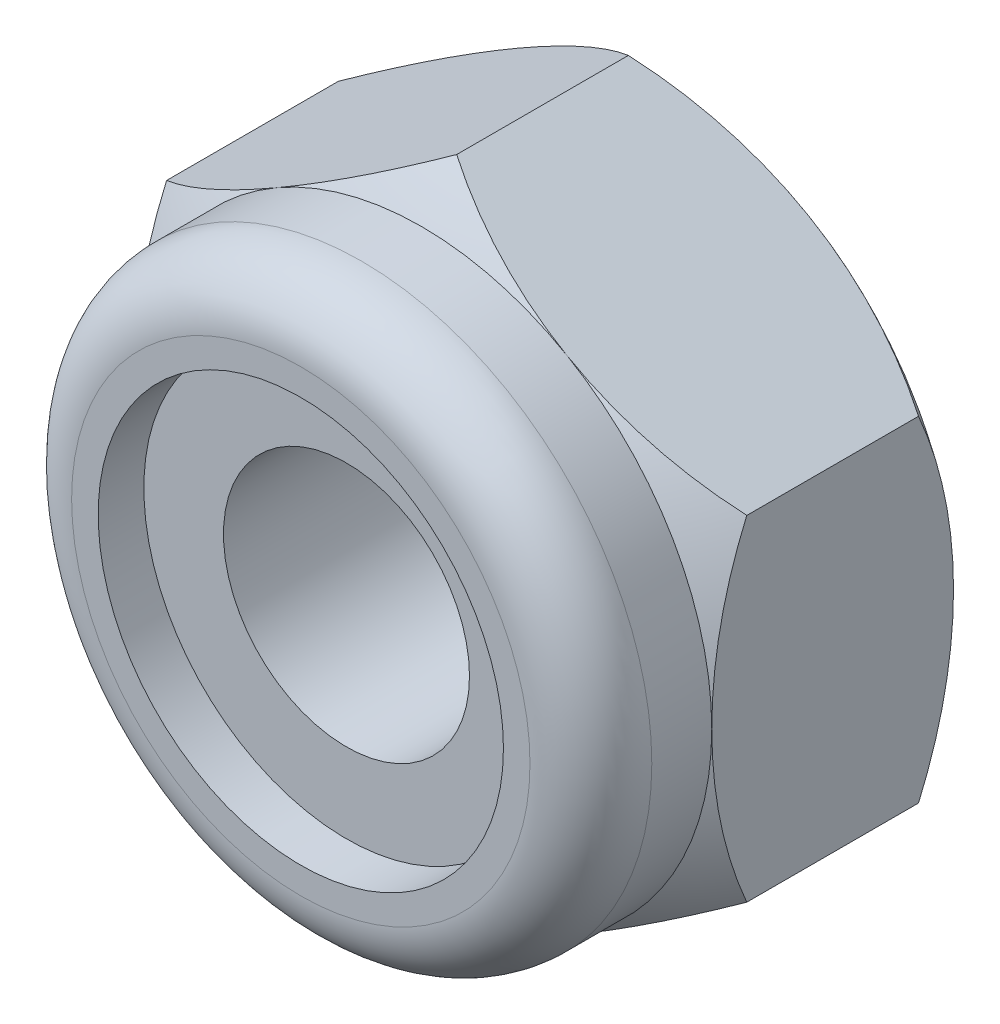
ISO-10303-21;
HEADER;
FILE_DESCRIPTION(('STEP AP214'),'2;1');
FILE_NAME('part.step','',(''),(''),'','','');
FILE_SCHEMA(('AUTOMOTIVE_DESIGN { 1 0 10303 214 1 1 1 1 }'));
ENDSEC;
DATA;
#1=APPLICATION_CONTEXT('core data for automotive mechanical design processes');
#2=APPLICATION_PROTOCOL_DEFINITION('international standard','automotive_design',2000,#1);
#3=PRODUCT_CONTEXT('',#1,'mechanical');
#4=PRODUCT('Part','Part','',(#3));
#5=PRODUCT_RELATED_PRODUCT_CATEGORY('part','',(#4));
#6=PRODUCT_DEFINITION_FORMATION('','',#4);
#7=PRODUCT_DEFINITION_CONTEXT('part definition',#1,'design');
#8=PRODUCT_DEFINITION('design','',#6,#7);
#9=PRODUCT_DEFINITION_SHAPE('','',#8);
#10=(LENGTH_UNIT() NAMED_UNIT(*) SI_UNIT(.MILLI.,.METRE.));
#11=(NAMED_UNIT(*) PLANE_ANGLE_UNIT() SI_UNIT($,.RADIAN.));
#12=(NAMED_UNIT(*) SI_UNIT($,.STERADIAN.) SOLID_ANGLE_UNIT());
#13=UNCERTAINTY_MEASURE_WITH_UNIT(LENGTH_MEASURE(1.E-05),#10,'distance_accuracy_value','');
#14=(GEOMETRIC_REPRESENTATION_CONTEXT(3) GLOBAL_UNCERTAINTY_ASSIGNED_CONTEXT((#13)) GLOBAL_UNIT_ASSIGNED_CONTEXT((#10,
#11,#12)) REPRESENTATION_CONTEXT('',''));
#15=CARTESIAN_POINT('',(0.,0.,0.));
#16=DIRECTION('',(0.,0.,1.));
#17=DIRECTION('',(1.,0.,0.));
#18=AXIS2_PLACEMENT_3D('',#15,#16,#17);
#19=CARTESIAN_POINT('',(0.,0.,4.953125));
#20=DIRECTION('',(0.,0.,1.));
#21=DIRECTION('',(1.,0.,0.));
#22=AXIS2_PLACEMENT_3D('',#19,#20,#21);
#23=TOROIDAL_SURFACE('',#22,3.7625,1.);
#24=CARTESIAN_POINT('',(0.,0.,4.953125));
#25=DIRECTION('',(0.,0.,-1.));
#26=DIRECTION('',(-1.,0.,0.));
#27=AXIS2_PLACEMENT_3D('',#24,#25,#26);
#28=CIRCLE('',#27,4.7625);
#29=CARTESIAN_POINT('',(-4.7625,0.,4.953125));
#30=VERTEX_POINT('',#29);
#31=EDGE_CURVE('E126',#30,#30,#28,.T.);
#32=ORIENTED_EDGE('',*,*,#31,.F.);
#33=EDGE_LOOP('',(#32));
#34=FACE_BOUND('',#33,.T.);
#35=CARTESIAN_POINT('',(0.,0.,5.953125));
#36=DIRECTION('',(0.,0.,-1.));
#37=DIRECTION('',(1.,0.,0.));
#38=AXIS2_PLACEMENT_3D('',#35,#36,#37);
#39=CIRCLE('',#38,3.7625);
#40=CARTESIAN_POINT('',(-3.7625,0.,5.953125));
#41=VERTEX_POINT('',#40);
#42=CARTESIAN_POINT('',(3.7625,0.,5.953125));
#43=VERTEX_POINT('',#42);
#44=EDGE_CURVE('E116',#41,#43,#39,.F.);
#45=ORIENTED_EDGE('',*,*,#44,.F.);
#46=CARTESIAN_POINT('',(0.,0.,5.953125));
#47=DIRECTION('',(0.,0.,-1.));
#48=DIRECTION('',(-1.,0.,0.));
#49=AXIS2_PLACEMENT_3D('',#46,#47,#48);
#50=CIRCLE('',#49,3.7625);
#51=EDGE_CURVE('E120',#43,#41,#50,.F.);
#52=ORIENTED_EDGE('',*,*,#51,.F.);
#53=EDGE_LOOP('',(#45,#52));
#54=FACE_BOUND('',#53,.T.);
#55=ADVANCED_FACE('F18',(#34,#54),#23,.T.);
#56=CARTESIAN_POINT('',(0.,0.,5.953125));
#57=DIRECTION('',(0.,0.,1.));
#58=DIRECTION('',(1.,0.,0.));
#59=AXIS2_PLACEMENT_3D('',#56,#57,#58);
#60=PLANE('',#59);
#61=CARTESIAN_POINT('',(0.,0.,5.953125));
#62=DIRECTION('',(0.,0.,1.));
#63=DIRECTION('',(1.,0.,0.));
#64=AXIS2_PLACEMENT_3D('',#61,#62,#63);
#65=CIRCLE('',#64,3.32676299779793);
#66=CARTESIAN_POINT('',(3.32676299779793,0.,5.953125));
#67=VERTEX_POINT('',#66);
#68=EDGE_CURVE('E272',#67,#67,#65,.F.);
#69=ORIENTED_EDGE('',*,*,#68,.T.);
#70=EDGE_LOOP('',(#69));
#71=FACE_BOUND('',#70,.T.);
#72=ORIENTED_EDGE('',*,*,#51,.T.);
#73=ORIENTED_EDGE('',*,*,#44,.T.);
#74=EDGE_LOOP('',(#72,#73));
#75=FACE_BOUND('',#74,.T.);
#76=ADVANCED_FACE('F125',(#71,#75),#60,.T.);
#77=CARTESIAN_POINT('',(0.,0.,5.953125));
#78=DIRECTION('',(0.,0.,-1.));
#79=DIRECTION('',(-1.,0.,0.));
#80=AXIS2_PLACEMENT_3D('',#77,#78,#79);
#81=CYLINDRICAL_SURFACE('',#80,4.7625);
#82=ORIENTED_EDGE('',*,*,#31,.T.);
#83=EDGE_LOOP('',(#82));
#84=FACE_BOUND('',#83,.T.);
#85=CARTESIAN_POINT('',(0.,0.,3.96875000000001));
#86=DIRECTION('',(0.,0.,-1.));
#87=DIRECTION('',(-1.,0.,0.));
#88=AXIS2_PLACEMENT_3D('',#85,#86,#87);
#89=CIRCLE('',#88,4.7625);
#90=CARTESIAN_POINT('',(2.38124999999999,-4.1244459855234,3.96875000000001));
#91=VERTEX_POINT('',#90);
#92=CARTESIAN_POINT('',(-2.38125,-4.12444598552339,3.96875000000002));
#93=VERTEX_POINT('',#92);
#94=EDGE_CURVE('E109',#91,#93,#89,.T.);
#95=ORIENTED_EDGE('',*,*,#94,.F.);
#96=CARTESIAN_POINT('',(0.,0.,3.96875000000001));
#97=DIRECTION('',(0.,0.,-1.));
#98=DIRECTION('',(-1.,0.,0.));
#99=AXIS2_PLACEMENT_3D('',#96,#97,#98);
#100=CIRCLE('',#99,4.7625);
#101=CARTESIAN_POINT('',(4.76249999999074,0.,3.96875000000645));
#102=VERTEX_POINT('',#101);
#103=EDGE_CURVE('E258',#102,#91,#100,.T.);
#104=ORIENTED_EDGE('',*,*,#103,.F.);
#105=CARTESIAN_POINT('',(0.,0.,3.96875000000001));
#106=DIRECTION('',(0.,0.,-1.));
#107=DIRECTION('',(-1.,0.,0.));
#108=AXIS2_PLACEMENT_3D('',#105,#106,#107);
#109=CIRCLE('',#108,4.7625);
#110=CARTESIAN_POINT('',(2.38125,4.12444598552339,3.96875000000001));
#111=VERTEX_POINT('',#110);
#112=EDGE_CURVE('E260',#111,#102,#109,.T.);
#113=ORIENTED_EDGE('',*,*,#112,.F.);
#114=CARTESIAN_POINT('',(0.,0.,3.96875000000001));
#115=DIRECTION('',(0.,0.,-1.));
#116=DIRECTION('',(-1.,0.,0.));
#117=AXIS2_PLACEMENT_3D('',#114,#115,#116);
#118=CIRCLE('',#117,4.7625);
#119=CARTESIAN_POINT('',(-2.38125,4.12444598552339,3.96875000000001));
#120=VERTEX_POINT('',#119);
#121=EDGE_CURVE('E263',#120,#111,#118,.T.);
#122=ORIENTED_EDGE('',*,*,#121,.F.);
#123=CARTESIAN_POINT('',(0.,0.,3.96875000000001));
#124=DIRECTION('',(0.,0.,-1.));
#125=DIRECTION('',(-1.,0.,0.));
#126=AXIS2_PLACEMENT_3D('',#123,#124,#125);
#127=CIRCLE('',#126,4.7625);
#128=CARTESIAN_POINT('',(-4.76249999999074,0.,3.96875000000645));
#129=VERTEX_POINT('',#128);
#130=EDGE_CURVE('E266',#129,#120,#127,.T.);
#131=ORIENTED_EDGE('',*,*,#130,.F.);
#132=CARTESIAN_POINT('',(0.,0.,3.96875000000001));
#133=DIRECTION('',(0.,0.,-1.));
#134=DIRECTION('',(-1.,0.,0.));
#135=AXIS2_PLACEMENT_3D('',#132,#133,#134);
#136=CIRCLE('',#135,4.7625);
#137=EDGE_CURVE('E269',#93,#129,#136,.T.);
#138=ORIENTED_EDGE('',*,*,#137,.F.);
#139=EDGE_LOOP('',(#95,#104,#113,#122,#131,#138));
#140=FACE_BOUND('',#139,.T.);
#141=ADVANCED_FACE('F144',(#84,#140),#81,.T.);
#142=CARTESIAN_POINT('',(0.,0.,5.953125));
#143=DIRECTION('',(0.,0.,1.));
#144=DIRECTION('',(1.,0.,0.));
#145=AXIS2_PLACEMENT_3D('',#142,#143,#144);
#146=CYLINDRICAL_SURFACE('',#145,3.32676299779793);
#147=CARTESIAN_POINT('',(0.,0.,5.203125));
#148=DIRECTION('',(0.,0.,1.));
#149=DIRECTION('',(1.,0.,0.));
#150=AXIS2_PLACEMENT_3D('',#147,#148,#149);
#151=CIRCLE('',#150,3.32676299779793);
#152=CARTESIAN_POINT('',(3.32676299779793,0.,5.203125));
#153=VERTEX_POINT('',#152);
#154=EDGE_CURVE('E255',#153,#153,#151,.F.);
#155=ORIENTED_EDGE('',*,*,#154,.T.);
#156=EDGE_LOOP('',(#155));
#157=FACE_BOUND('',#156,.T.);
#158=ORIENTED_EDGE('',*,*,#68,.F.);
#159=EDGE_LOOP('',(#158));
#160=FACE_BOUND('',#159,.T.);
#161=ADVANCED_FACE('F279',(#157,#160),#146,.F.);
#162=CARTESIAN_POINT('',(0.,0.,-2.89662617308756));
#163=DIRECTION('',(1.,0.,0.));
#164=DIRECTION('',(0.,-0.514062280042824,0.857752861981336));
#165=AXIS2_PLACEMENT_3D('',#162,#163,#164);
#166=SPHERICAL_SURFACE('',#165,8.35552489362569);
#167=CARTESIAN_POINT('',(2.38125,-4.12444598552339,-2.89662617308756));
#168=DIRECTION('',(0.5,-0.866025403784439,0.));
#169=DIRECTION('',(0.866025403784439,0.5,0.));
#170=AXIS2_PLACEMENT_3D('',#167,#168,#169);
#171=CIRCLE('',#170,6.86537617308758);
#172=CARTESIAN_POINT('',(3.7397602375977E-11,-5.49926131405278,3.39407499989476));
#173=VERTEX_POINT('',#172);
#174=EDGE_CURVE('E250',#91,#173,#171,.T.);
#175=ORIENTED_EDGE('',*,*,#174,.F.);
#176=ORIENTED_EDGE('',*,*,#94,.T.);
#177=CARTESIAN_POINT('',(-2.38125,-4.12444598552339,-2.89662617308756));
#178=DIRECTION('',(-0.5,-0.866025403784439,0.));
#179=DIRECTION('',(0.866025403784439,-0.5,0.));
#180=AXIS2_PLACEMENT_3D('',#177,#178,#179);
#181=CIRCLE('',#180,6.86537617308758);
#182=EDGE_CURVE('E246',#173,#93,#181,.T.);
#183=ORIENTED_EDGE('',*,*,#182,.F.);
#184=EDGE_LOOP('',(#175,#176,#183));
#185=FACE_BOUND('',#184,.T.);
#186=ADVANCED_FACE('F152',(#185),#166,.T.);
#187=CARTESIAN_POINT('',(0.,0.,-2.89662617308763));
#188=DIRECTION('',(1.,0.,0.));
#189=DIRECTION('',(0.,0.00324586478599379,0.999994732167021));
#190=AXIS2_PLACEMENT_3D('',#187,#188,#189);
#191=SPHERICAL_SURFACE('',#190,8.35552489362577);
#192=CARTESIAN_POINT('',(-2.38124999999997,-4.12444598552341,-2.89662617308763));
#193=DIRECTION('',(-0.5,-0.866025403784439,0.));
#194=DIRECTION('',(0.866025403784439,-0.5,0.));
#195=AXIS2_PLACEMENT_3D('',#192,#193,#194);
#196=CIRCLE('',#195,6.86537617308765);
#197=CARTESIAN_POINT('',(-4.7625,-2.74963065700324,3.39407499991903));
#198=VERTEX_POINT('',#197);
#199=EDGE_CURVE('E244',#93,#198,#196,.T.);
#200=ORIENTED_EDGE('',*,*,#199,.F.);
#201=ORIENTED_EDGE('',*,*,#137,.T.);
#202=CARTESIAN_POINT('',(-4.7625,0.,-2.89662617308763));
#203=DIRECTION('',(1.,0.,0.));
#204=DIRECTION('',(0.,0.,-1.));
#205=AXIS2_PLACEMENT_3D('',#202,#203,#204);
#206=CIRCLE('',#205,6.86537617308764);
#207=EDGE_CURVE('E240',#198,#129,#206,.F.);
#208=ORIENTED_EDGE('',*,*,#207,.F.);
#209=EDGE_LOOP('',(#200,#201,#208));
#210=FACE_BOUND('',#209,.T.);
#211=ADVANCED_FACE('F392',(#210),#191,.T.);
#212=CARTESIAN_POINT('',(0.,0.,-2.8966261730876));
#213=DIRECTION('',(1.,0.,0.));
#214=DIRECTION('',(0.,0.517754599312685,0.855529178281233));
#215=AXIS2_PLACEMENT_3D('',#212,#213,#214);
#216=SPHERICAL_SURFACE('',#215,8.35552489362575);
#217=CARTESIAN_POINT('',(-4.76249999998147,0.,-2.8966261730876));
#218=DIRECTION('',(1.,0.,0.));
#219=DIRECTION('',(0.,0.,-1.));
#220=AXIS2_PLACEMENT_3D('',#217,#218,#219);
#221=CIRCLE('',#220,6.86537617310048);
#222=CARTESIAN_POINT('',(-4.76249999994795,2.74963065704565,3.39407499993991));
#223=VERTEX_POINT('',#222);
#224=EDGE_CURVE('E238',#129,#223,#221,.F.);
#225=ORIENTED_EDGE('',*,*,#224,.F.);
#226=ORIENTED_EDGE('',*,*,#130,.T.);
#227=CARTESIAN_POINT('',(-2.38125,4.12444598552339,-2.8966261730876));
#228=DIRECTION('',(-0.5,0.866025403784439,0.));
#229=DIRECTION('',(-0.866025403784439,-0.5,0.));
#230=AXIS2_PLACEMENT_3D('',#227,#228,#229);
#231=CIRCLE('',#230,6.86537617308761);
#232=EDGE_CURVE('E234',#223,#120,#231,.T.);
#233=ORIENTED_EDGE('',*,*,#232,.F.);
#234=EDGE_LOOP('',(#225,#226,#233));
#235=FACE_BOUND('',#234,.T.);
#236=ADVANCED_FACE('F404',(#235),#216,.T.);
#237=CARTESIAN_POINT('',(0.,0.,-2.89662617308755));
#238=DIRECTION('',(1.,0.,0.));
#239=DIRECTION('',(0.,0.658959645209422,0.752178294013775));
#240=AXIS2_PLACEMENT_3D('',#237,#238,#239);
#241=SPHERICAL_SURFACE('',#240,8.35552489362568);
#242=ORIENTED_EDGE('',*,*,#121,.T.);
#243=CARTESIAN_POINT('',(2.38125,4.12444598552339,-2.89662617308755));
#244=DIRECTION('',(0.5,0.866025403784439,0.));
#245=DIRECTION('',(-0.866025403784439,0.5,0.));
#246=AXIS2_PLACEMENT_3D('',#243,#244,#245);
#247=CIRCLE('',#246,6.86537617308756);
#248=CARTESIAN_POINT('',(4.83339496898383E-11,5.49926131400328,3.39407499993803));
#249=VERTEX_POINT('',#248);
#250=EDGE_CURVE('E228',#249,#111,#247,.T.);
#251=ORIENTED_EDGE('',*,*,#250,.F.);
#252=CARTESIAN_POINT('',(-2.38125,4.12444598552339,-2.89662617308755));
#253=DIRECTION('',(-0.5,0.866025403784439,0.));
#254=DIRECTION('',(-0.866025403784439,-0.5,0.));
#255=AXIS2_PLACEMENT_3D('',#252,#253,#254);
#256=CIRCLE('',#255,6.86537617308756);
#257=EDGE_CURVE('E232',#120,#249,#256,.T.);
#258=ORIENTED_EDGE('',*,*,#257,.F.);
#259=EDGE_LOOP('',(#242,#251,#258));
#260=FACE_BOUND('',#259,.T.);
#261=ADVANCED_FACE('F342',(#260),#241,.T.);
#262=CARTESIAN_POINT('',(0.,0.,-2.89662617308758));
#263=DIRECTION('',(1.,0.,0.));
#264=DIRECTION('',(0.,0.517754599312686,0.855529178281232));
#265=AXIS2_PLACEMENT_3D('',#262,#263,#264);
#266=SPHERICAL_SURFACE('',#265,8.35552489362574);
#267=ORIENTED_EDGE('',*,*,#112,.T.);
#268=CARTESIAN_POINT('',(4.76250000000002,0.,-2.89662617308758));
#269=DIRECTION('',(1.,0.,0.));
#270=DIRECTION('',(0.,0.,-1.));
#271=AXIS2_PLACEMENT_3D('',#268,#269,#270);
#272=CIRCLE('',#271,6.86537617308761);
#273=CARTESIAN_POINT('',(4.76250000000002,2.74963065695978,3.39407499993802));
#274=VERTEX_POINT('',#273);
#275=EDGE_CURVE('E222',#274,#102,#272,.T.);
#276=ORIENTED_EDGE('',*,*,#275,.F.);
#277=CARTESIAN_POINT('',(2.38125,4.12444598552339,-2.89662617308758));
#278=DIRECTION('',(0.5,0.866025403784439,0.));
#279=DIRECTION('',(-0.866025403784439,0.5,0.));
#280=AXIS2_PLACEMENT_3D('',#277,#278,#279);
#281=CIRCLE('',#280,6.8653761730876);
#282=EDGE_CURVE('E226',#111,#274,#281,.T.);
#283=ORIENTED_EDGE('',*,*,#282,.F.);
#284=EDGE_LOOP('',(#267,#276,#283));
#285=FACE_BOUND('',#284,.T.);
#286=ADVANCED_FACE('F331',(#285),#266,.T.);
#287=CARTESIAN_POINT('',(0.,0.,-2.89662617308762));
#288=DIRECTION('',(1.,0.,0.));
#289=DIRECTION('',(0.,0.00324586478599379,0.999994732167021));
#290=AXIS2_PLACEMENT_3D('',#287,#288,#289);
#291=SPHERICAL_SURFACE('',#290,8.35552489362576);
#292=ORIENTED_EDGE('',*,*,#103,.T.);
#293=CARTESIAN_POINT('',(2.38124999999997,-4.12444598552341,-2.89662617308762));
#294=DIRECTION('',(0.5,-0.866025403784439,0.));
#295=DIRECTION('',(0.866025403784439,0.5,0.));
#296=AXIS2_PLACEMENT_3D('',#293,#294,#295);
#297=CIRCLE('',#296,6.86537617308765);
#298=CARTESIAN_POINT('',(4.76249999998147,-2.74963065704565,3.39407499991453));
#299=VERTEX_POINT('',#298);
#300=EDGE_CURVE('E252',#299,#91,#297,.T.);
#301=ORIENTED_EDGE('',*,*,#300,.F.);
#302=CARTESIAN_POINT('',(4.76249999998147,0.,-2.89662617308762));
#303=DIRECTION('',(1.,0.,0.));
#304=DIRECTION('',(0.,0.,-1.));
#305=AXIS2_PLACEMENT_3D('',#302,#303,#304);
#306=CIRCLE('',#305,6.86537617310049);
#307=EDGE_CURVE('E219',#102,#299,#306,.T.);
#308=ORIENTED_EDGE('',*,*,#307,.F.);
#309=EDGE_LOOP('',(#292,#301,#308));
#310=FACE_BOUND('',#309,.T.);
#311=ADVANCED_FACE('F326',(#310),#291,.T.);
#312=CARTESIAN_POINT('',(2.01930000000001,0.,5.203125));
#313=DIRECTION('',(0.,0.,-1.));
#314=DIRECTION('',(-1.,0.,0.));
#315=AXIS2_PLACEMENT_3D('',#312,#313,#314);
#316=PLANE('',#315);
#317=ORIENTED_EDGE('',*,*,#154,.F.);
#318=EDGE_LOOP('',(#317));
#319=FACE_BOUND('',#318,.T.);
#320=CARTESIAN_POINT('',(0.,0.,5.203125));
#321=DIRECTION('',(0.,0.,1.));
#322=DIRECTION('',(1.,0.,0.));
#323=AXIS2_PLACEMENT_3D('',#320,#321,#322);
#324=CIRCLE('',#323,2.01930000000001);
#325=CARTESIAN_POINT('',(2.01930000000001,0.,5.203125));
#326=VERTEX_POINT('',#325);
#327=EDGE_CURVE('E215',#326,#326,#324,.F.);
#328=ORIENTED_EDGE('',*,*,#327,.T.);
#329=EDGE_LOOP('',(#328));
#330=FACE_BOUND('',#329,.T.);
#331=ADVANCED_FACE('F323',(#319,#330),#316,.F.);
#332=CARTESIAN_POINT('',(2.38125,-4.12444598552339,1.984375));
#333=DIRECTION('',(0.5,-0.866025403784439,0.));
#334=DIRECTION('',(0.866025403784439,0.5,0.));
#335=AXIS2_PLACEMENT_3D('',#332,#333,#334);
#336=PLANE('',#335);
#337=CARTESIAN_POINT('',(2.38125,-4.12444598552339,6.86537617308756));
#338=DIRECTION('',(0.5,-0.866025403784439,0.));
#339=DIRECTION('',(0.866025403784439,0.5,0.));
#340=AXIS2_PLACEMENT_3D('',#337,#338,#339);
#341=CIRCLE('',#340,6.86537617308756);
#342=CARTESIAN_POINT('',(2.38124999999999,-4.1244459855234,0.));
#343=VERTEX_POINT('',#342);
#344=CARTESIAN_POINT('',(3.7397602375977E-11,-5.49926131405278,0.574675000105257));
#345=VERTEX_POINT('',#344);
#346=EDGE_CURVE('E206',#343,#345,#341,.F.);
#347=ORIENTED_EDGE('',*,*,#346,.F.);
#348=CARTESIAN_POINT('',(2.38124999999998,-4.1244459855234,6.8653761730876));
#349=DIRECTION('',(0.5,-0.866025403784439,0.));
#350=DIRECTION('',(0.866025403784439,0.5,0.));
#351=AXIS2_PLACEMENT_3D('',#348,#349,#350);
#352=CIRCLE('',#351,6.8653761730876);
#353=CARTESIAN_POINT('',(4.76249999999999,-2.7496306570403,0.57467500009718));
#354=VERTEX_POINT('',#353);
#355=EDGE_CURVE('E209',#354,#343,#352,.F.);
#356=ORIENTED_EDGE('',*,*,#355,.F.);
#357=DIRECTION('',(0.,0.,-1.));
#358=VECTOR('',#357,1.);
#359=CARTESIAN_POINT('',(4.7625,-2.749630657065,1.984375));
#360=LINE('',#359,#358);
#361=EDGE_CURVE('E218',#299,#354,#360,.T.);
#362=ORIENTED_EDGE('',*,*,#361,.F.);
#363=ORIENTED_EDGE('',*,*,#300,.T.);
#364=ORIENTED_EDGE('',*,*,#174,.T.);
#365=DIRECTION('',(0.,0.,1.));
#366=VECTOR('',#365,1.);
#367=CARTESIAN_POINT('',(7.4795204751954E-11,-5.49926131407437,1.984375));
#368=LINE('',#367,#366);
#369=EDGE_CURVE('E249',#345,#173,#368,.T.);
#370=ORIENTED_EDGE('',*,*,#369,.F.);
#371=EDGE_LOOP('',(#347,#356,#362,#363,#364,#370));
#372=FACE_BOUND('',#371,.T.);
#373=ADVANCED_FACE('F319',(#372),#336,.T.);
#374=CARTESIAN_POINT('',(-2.38125,-4.12444598552339,1.984375));
#375=DIRECTION('',(-0.5,-0.866025403784439,0.));
#376=DIRECTION('',(0.866025403784439,-0.5,0.));
#377=AXIS2_PLACEMENT_3D('',#374,#375,#376);
#378=PLANE('',#377);
#379=CARTESIAN_POINT('',(-2.38124999999997,-4.12444598552341,6.86537617308762));
#380=DIRECTION('',(-0.5,-0.866025403784439,0.));
#381=DIRECTION('',(0.866025403784439,-0.5,0.));
#382=AXIS2_PLACEMENT_3D('',#379,#380,#381);
#383=CIRCLE('',#382,6.86537617308762);
#384=CARTESIAN_POINT('',(-2.38124999999998,-4.1244459855234,0.));
#385=VERTEX_POINT('',#384);
#386=CARTESIAN_POINT('',(-4.7624999999984,-2.74963065700015,0.57467500007843));
#387=VERTEX_POINT('',#386);
#388=EDGE_CURVE('E197',#385,#387,#383,.F.);
#389=ORIENTED_EDGE('',*,*,#388,.F.);
#390=CARTESIAN_POINT('',(-2.38125,-4.12444598552339,6.86537617308756));
#391=DIRECTION('',(-0.5,-0.866025403784439,0.));
#392=DIRECTION('',(0.866025403784439,-0.5,0.));
#393=AXIS2_PLACEMENT_3D('',#390,#391,#392);
#394=CIRCLE('',#393,6.86537617308756);
#395=EDGE_CURVE('E203',#345,#385,#394,.F.);
#396=ORIENTED_EDGE('',*,*,#395,.F.);
#397=ORIENTED_EDGE('',*,*,#369,.T.);
#398=ORIENTED_EDGE('',*,*,#182,.T.);
#399=ORIENTED_EDGE('',*,*,#199,.T.);
#400=DIRECTION('',(0.,0.,1.));
#401=VECTOR('',#400,1.);
#402=CARTESIAN_POINT('',(-4.7625,-2.74963065699089,1.984375));
#403=LINE('',#402,#401);
#404=EDGE_CURVE('E243',#387,#198,#403,.T.);
#405=ORIENTED_EDGE('',*,*,#404,.F.);
#406=EDGE_LOOP('',(#389,#396,#397,#398,#399,#405));
#407=FACE_BOUND('',#406,.T.);
#408=ADVANCED_FACE('F315',(#407),#378,.T.);
#409=CARTESIAN_POINT('',(-4.7625,0.,1.984375));
#410=DIRECTION('',(-1.,0.,0.));
#411=DIRECTION('',(0.,0.,1.));
#412=AXIS2_PLACEMENT_3D('',#409,#410,#411);
#413=PLANE('',#412);
#414=CARTESIAN_POINT('',(-4.76249999999999,0.,6.86537617308759));
#415=DIRECTION('',(1.,0.,0.));
#416=DIRECTION('',(0.,0.,-1.));
#417=AXIS2_PLACEMENT_3D('',#414,#415,#416);
#418=CIRCLE('',#417,6.86537617308759);
#419=CARTESIAN_POINT('',(-4.76249999999651,0.,-2.40324253553137E-12));
#420=VERTEX_POINT('',#419);
#421=CARTESIAN_POINT('',(-4.76249999995721,2.7496306570403,0.574675000064784));
#422=VERTEX_POINT('',#421);
#423=EDGE_CURVE('E194',#420,#422,#418,.T.);
#424=ORIENTED_EDGE('',*,*,#423,.F.);
#425=CARTESIAN_POINT('',(-4.7624999999861,0.,6.86537617308762));
#426=DIRECTION('',(1.,0.,0.));
#427=DIRECTION('',(0.,0.,-1.));
#428=AXIS2_PLACEMENT_3D('',#425,#426,#427);
#429=CIRCLE('',#428,6.86537617309723);
#430=EDGE_CURVE('E200',#387,#420,#429,.T.);
#431=ORIENTED_EDGE('',*,*,#430,.F.);
#432=ORIENTED_EDGE('',*,*,#404,.T.);
#433=ORIENTED_EDGE('',*,*,#207,.T.);
#434=ORIENTED_EDGE('',*,*,#224,.T.);
#435=DIRECTION('',(0.,0.,1.));
#436=VECTOR('',#435,1.);
#437=CARTESIAN_POINT('',(-4.76249999991443,2.749630657065,1.984375));
#438=LINE('',#437,#436);
#439=EDGE_CURVE('E237',#422,#223,#438,.T.);
#440=ORIENTED_EDGE('',*,*,#439,.F.);
#441=EDGE_LOOP('',(#424,#431,#432,#433,#434,#440));
#442=FACE_BOUND('',#441,.T.);
#443=ADVANCED_FACE('F311',(#442),#413,.T.);
#444=CARTESIAN_POINT('',(-2.38125,4.12444598552339,1.984375));
#445=DIRECTION('',(-0.5,0.866025403784439,0.));
#446=DIRECTION('',(-0.866025403784439,-0.5,0.));
#447=AXIS2_PLACEMENT_3D('',#444,#445,#446);
#448=PLANE('',#447);
#449=CARTESIAN_POINT('',(-2.38125,4.12444598552339,6.86537617308756));
#450=DIRECTION('',(-0.5,0.866025403784439,0.));
#451=DIRECTION('',(-0.866025403784439,-0.5,0.));
#452=AXIS2_PLACEMENT_3D('',#449,#450,#451);
#453=CIRCLE('',#452,6.86537617308756);
#454=CARTESIAN_POINT('',(-2.38125,4.12444598552339,0.));
#455=VERTEX_POINT('',#454);
#456=CARTESIAN_POINT('',(4.8334708631359E-11,5.49926131400328,0.574675000061985));
#457=VERTEX_POINT('',#456);
#458=EDGE_CURVE('E188',#455,#457,#453,.F.);
#459=ORIENTED_EDGE('',*,*,#458,.F.);
#460=CARTESIAN_POINT('',(-2.38124999999999,4.12444598552339,6.86537617308758));
#461=DIRECTION('',(-0.5,0.866025403784439,0.));
#462=DIRECTION('',(-0.866025403784439,-0.5,0.));
#463=AXIS2_PLACEMENT_3D('',#460,#461,#462);
#464=CIRCLE('',#463,6.86537617308758);
#465=EDGE_CURVE('E191',#422,#455,#464,.F.);
#466=ORIENTED_EDGE('',*,*,#465,.F.);
#467=ORIENTED_EDGE('',*,*,#439,.T.);
#468=ORIENTED_EDGE('',*,*,#232,.T.);
#469=ORIENTED_EDGE('',*,*,#257,.T.);
#470=DIRECTION('',(0.,0.,1.));
#471=VECTOR('',#470,1.);
#472=CARTESIAN_POINT('',(9.66692004222836E-11,5.49926131397537,1.984375));
#473=LINE('',#472,#471);
#474=EDGE_CURVE('E231',#457,#249,#473,.T.);
#475=ORIENTED_EDGE('',*,*,#474,.F.);
#476=EDGE_LOOP('',(#459,#466,#467,#468,#469,#475));
#477=FACE_BOUND('',#476,.T.);
#478=ADVANCED_FACE('F308',(#477),#448,.T.);
#479=CARTESIAN_POINT('',(2.38125,4.12444598552339,1.984375));
#480=DIRECTION('',(0.5,0.866025403784439,0.));
#481=DIRECTION('',(-0.866025403784439,0.5,0.));
#482=AXIS2_PLACEMENT_3D('',#479,#480,#481);
#483=PLANE('',#482);
#484=CARTESIAN_POINT('',(2.38125,4.12444598552339,6.86537617308756));
#485=DIRECTION('',(0.5,0.866025403784439,0.));
#486=DIRECTION('',(-0.866025403784439,0.5,0.));
#487=AXIS2_PLACEMENT_3D('',#484,#485,#486);
#488=CIRCLE('',#487,6.86537617308756);
#489=CARTESIAN_POINT('',(2.38125,4.12444598552339,0.));
#490=VERTEX_POINT('',#489);
#491=CARTESIAN_POINT('',(4.7625000000072,2.7496306569577,0.574675000066536));
#492=VERTEX_POINT('',#491);
#493=EDGE_CURVE('E39',#490,#492,#488,.F.);
#494=ORIENTED_EDGE('',*,*,#493,.F.);
#495=CARTESIAN_POINT('',(2.38125,4.12444598552339,6.86537617308756));
#496=DIRECTION('',(0.5,0.866025403784439,0.));
#497=DIRECTION('',(-0.866025403784439,0.5,0.));
#498=AXIS2_PLACEMENT_3D('',#495,#496,#497);
#499=CIRCLE('',#498,6.86537617308756);
#500=EDGE_CURVE('E186',#457,#490,#499,.F.);
#501=ORIENTED_EDGE('',*,*,#500,.F.);
#502=ORIENTED_EDGE('',*,*,#474,.T.);
#503=ORIENTED_EDGE('',*,*,#250,.T.);
#504=ORIENTED_EDGE('',*,*,#282,.T.);
#505=DIRECTION('',(0.,0.,-1.));
#506=VECTOR('',#505,1.);
#507=CARTESIAN_POINT('',(4.7625,2.74963065690397,1.984375));
#508=LINE('',#507,#506);
#509=EDGE_CURVE('E225',#492,#274,#508,.F.);
#510=ORIENTED_EDGE('',*,*,#509,.F.);
#511=EDGE_LOOP('',(#494,#501,#502,#503,#504,#510));
#512=FACE_BOUND('',#511,.T.);
#513=ADVANCED_FACE('F304',(#512),#483,.T.);
#514=CARTESIAN_POINT('',(4.7625,0.,1.984375));
#515=DIRECTION('',(1.,0.,0.));
#516=DIRECTION('',(0.,0.,-1.));
#517=AXIS2_PLACEMENT_3D('',#514,#515,#516);
#518=PLANE('',#517);
#519=CARTESIAN_POINT('',(4.76249999999999,0.,6.8653761730876));
#520=DIRECTION('',(1.,0.,0.));
#521=DIRECTION('',(0.,0.,-1.));
#522=AXIS2_PLACEMENT_3D('',#519,#520,#521);
#523=CIRCLE('',#522,6.86537617308759);
#524=CARTESIAN_POINT('',(4.76250000000179,0.,1.25030194531028E-12));
#525=VERTEX_POINT('',#524);
#526=EDGE_CURVE('E212',#525,#354,#523,.F.);
#527=ORIENTED_EDGE('',*,*,#526,.F.);
#528=CARTESIAN_POINT('',(4.76250000000718,0.,6.86537617308758));
#529=DIRECTION('',(1.,0.,0.));
#530=DIRECTION('',(0.,0.,-1.));
#531=AXIS2_PLACEMENT_3D('',#528,#529,#530);
#532=CIRCLE('',#531,6.86537617308258);
#533=EDGE_CURVE('E182',#492,#525,#532,.F.);
#534=ORIENTED_EDGE('',*,*,#533,.F.);
#535=ORIENTED_EDGE('',*,*,#509,.T.);
#536=ORIENTED_EDGE('',*,*,#275,.T.);
#537=ORIENTED_EDGE('',*,*,#307,.T.);
#538=ORIENTED_EDGE('',*,*,#361,.T.);
#539=EDGE_LOOP('',(#527,#534,#535,#536,#537,#538));
#540=FACE_BOUND('',#539,.T.);
#541=ADVANCED_FACE('F300',(#540),#518,.T.);
#542=CARTESIAN_POINT('',(0.,0.,5.953125));
#543=DIRECTION('',(0.,0.,1.));
#544=DIRECTION('',(1.,0.,0.));
#545=AXIS2_PLACEMENT_3D('',#542,#543,#544);
#546=CYLINDRICAL_SURFACE('',#545,2.01930000000001);
#547=CARTESIAN_POINT('',(0.,0.,0.));
#548=DIRECTION('',(0.,0.,1.));
#549=DIRECTION('',(1.,0.,0.));
#550=AXIS2_PLACEMENT_3D('',#547,#548,#549);
#551=CIRCLE('',#550,2.01930000000001);
#552=CARTESIAN_POINT('',(2.01930000000001,0.,0.));
#553=VERTEX_POINT('',#552);
#554=EDGE_CURVE('E179',#553,#553,#551,.T.);
#555=ORIENTED_EDGE('',*,*,#554,.F.);
#556=EDGE_LOOP('',(#555));
#557=FACE_BOUND('',#556,.T.);
#558=ORIENTED_EDGE('',*,*,#327,.F.);
#559=EDGE_LOOP('',(#558));
#560=FACE_BOUND('',#559,.T.);
#561=ADVANCED_FACE('F296',(#557,#560),#546,.F.);
#562=CARTESIAN_POINT('',(0.,0.,6.8653761730876));
#563=DIRECTION('',(1.,0.,0.));
#564=DIRECTION('',(0.,-0.517754599312681,-0.855529178281235));
#565=AXIS2_PLACEMENT_3D('',#562,#563,#564);
#566=SPHERICAL_SURFACE('',#565,8.3555248936257);
#567=ORIENTED_EDGE('',*,*,#355,.T.);
#568=CARTESIAN_POINT('',(0.,0.,0.));
#569=DIRECTION('',(0.,0.,-1.));
#570=DIRECTION('',(-1.,0.,0.));
#571=AXIS2_PLACEMENT_3D('',#568,#569,#570);
#572=CIRCLE('',#571,4.76249999999999);
#573=EDGE_CURVE('E176',#525,#343,#572,.T.);
#574=ORIENTED_EDGE('',*,*,#573,.F.);
#575=ORIENTED_EDGE('',*,*,#526,.T.);
#576=EDGE_LOOP('',(#567,#574,#575));
#577=FACE_BOUND('',#576,.T.);
#578=ADVANCED_FACE('F299',(#577),#566,.T.);
#579=CARTESIAN_POINT('',(0.,0.,6.86537617308756));
#580=DIRECTION('',(1.,0.,0.));
#581=DIRECTION('',(0.,-0.658959645214411,-0.752178294009404));
#582=AXIS2_PLACEMENT_3D('',#579,#580,#581);
#583=SPHERICAL_SURFACE('',#582,8.35552489362568);
#584=ORIENTED_EDGE('',*,*,#395,.T.);
#585=CARTESIAN_POINT('',(0.,0.,0.));
#586=DIRECTION('',(0.,0.,-1.));
#587=DIRECTION('',(-1.,0.,0.));
#588=AXIS2_PLACEMENT_3D('',#585,#586,#587);
#589=CIRCLE('',#588,4.7625);
#590=EDGE_CURVE('E173',#343,#385,#589,.T.);
#591=ORIENTED_EDGE('',*,*,#590,.F.);
#592=ORIENTED_EDGE('',*,*,#346,.T.);
#593=EDGE_LOOP('',(#584,#591,#592));
#594=FACE_BOUND('',#593,.T.);
#595=ADVANCED_FACE('F349',(#594),#583,.T.);
#596=CARTESIAN_POINT('',(0.,0.,6.86537617308762));
#597=DIRECTION('',(1.,0.,0.));
#598=DIRECTION('',(0.,-0.517754599312678,-0.855529178281237));
#599=AXIS2_PLACEMENT_3D('',#596,#597,#598);
#600=SPHERICAL_SURFACE('',#599,8.35552489362571);
#601=CARTESIAN_POINT('',(0.,0.,0.));
#602=DIRECTION('',(0.,0.,-1.));
#603=DIRECTION('',(-1.,0.,0.));
#604=AXIS2_PLACEMENT_3D('',#601,#602,#603);
#605=CIRCLE('',#604,4.76249999999997);
#606=EDGE_CURVE('E170',#385,#420,#605,.T.);
#607=ORIENTED_EDGE('',*,*,#606,.F.);
#608=ORIENTED_EDGE('',*,*,#388,.T.);
#609=ORIENTED_EDGE('',*,*,#430,.T.);
#610=EDGE_LOOP('',(#607,#608,#609));
#611=FACE_BOUND('',#610,.T.);
#612=ADVANCED_FACE('F353',(#611),#600,.T.);
#613=CARTESIAN_POINT('',(0.,0.,6.86537617308758));
#614=DIRECTION('',(1.,0.,0.));
#615=DIRECTION('',(0.,-0.00324586478599368,-0.999994732167021));
#616=AXIS2_PLACEMENT_3D('',#613,#614,#615);
#617=SPHERICAL_SURFACE('',#616,8.3555248936257);
#618=ORIENTED_EDGE('',*,*,#465,.T.);
#619=CARTESIAN_POINT('',(0.,0.,0.));
#620=DIRECTION('',(0.,0.,-1.));
#621=DIRECTION('',(-1.,0.,0.));
#622=AXIS2_PLACEMENT_3D('',#619,#620,#621);
#623=CIRCLE('',#622,4.76250000000001);
#624=EDGE_CURVE('E167',#420,#455,#623,.T.);
#625=ORIENTED_EDGE('',*,*,#624,.F.);
#626=ORIENTED_EDGE('',*,*,#423,.T.);
#627=EDGE_LOOP('',(#618,#625,#626));
#628=FACE_BOUND('',#627,.T.);
#629=ADVANCED_FACE('F357',(#628),#617,.T.);
#630=CARTESIAN_POINT('',(0.,0.,6.86537617308756));
#631=DIRECTION('',(1.,0.,0.));
#632=DIRECTION('',(0.,0.51406228004279,-0.857752861981356));
#633=AXIS2_PLACEMENT_3D('',#630,#631,#632);
#634=SPHERICAL_SURFACE('',#633,8.35552489362568);
#635=ORIENTED_EDGE('',*,*,#500,.T.);
#636=CARTESIAN_POINT('',(0.,0.,0.));
#637=DIRECTION('',(0.,0.,-1.));
#638=DIRECTION('',(-1.,0.,0.));
#639=AXIS2_PLACEMENT_3D('',#636,#637,#638);
#640=CIRCLE('',#639,4.76250000000001);
#641=EDGE_CURVE('E30',#455,#490,#640,.T.);
#642=ORIENTED_EDGE('',*,*,#641,.F.);
#643=ORIENTED_EDGE('',*,*,#458,.T.);
#644=EDGE_LOOP('',(#635,#642,#643));
#645=FACE_BOUND('',#644,.T.);
#646=ADVANCED_FACE('F292',(#645),#634,.T.);
#647=CARTESIAN_POINT('',(0.,0.,6.86537617308756));
#648=DIRECTION('',(1.,0.,0.));
#649=DIRECTION('',(0.,-0.00324586478599372,-0.999994732167021));
#650=AXIS2_PLACEMENT_3D('',#647,#648,#649);
#651=SPHERICAL_SURFACE('',#650,8.35552489362567);
#652=ORIENTED_EDGE('',*,*,#533,.T.);
#653=CARTESIAN_POINT('',(0.,0.,0.));
#654=DIRECTION('',(0.,0.,-1.));
#655=DIRECTION('',(-1.,0.,0.));
#656=AXIS2_PLACEMENT_3D('',#653,#654,#655);
#657=CIRCLE('',#656,4.7625);
#658=EDGE_CURVE('E11',#490,#525,#657,.T.);
#659=ORIENTED_EDGE('',*,*,#658,.F.);
#660=ORIENTED_EDGE('',*,*,#493,.T.);
#661=EDGE_LOOP('',(#652,#659,#660));
#662=FACE_BOUND('',#661,.T.);
#663=ADVANCED_FACE('F20',(#662),#651,.T.);
#664=CARTESIAN_POINT('',(0.,0.,0.));
#665=DIRECTION('',(0.,0.,-1.));
#666=DIRECTION('',(-1.,0.,0.));
#667=AXIS2_PLACEMENT_3D('',#664,#665,#666);
#668=PLANE('',#667);
#669=ORIENTED_EDGE('',*,*,#641,.T.);
#670=ORIENTED_EDGE('',*,*,#658,.T.);
#671=ORIENTED_EDGE('',*,*,#573,.T.);
#672=ORIENTED_EDGE('',*,*,#590,.T.);
#673=ORIENTED_EDGE('',*,*,#606,.T.);
#674=ORIENTED_EDGE('',*,*,#624,.T.);
#675=EDGE_LOOP('',(#669,#670,#671,#672,#673,#674));
#676=FACE_BOUND('',#675,.T.);
#677=ORIENTED_EDGE('',*,*,#554,.T.);
#678=EDGE_LOOP('',(#677));
#679=FACE_BOUND('',#678,.T.);
#680=ADVANCED_FACE('F285',(#676,#679),#668,.T.);
#681=CLOSED_SHELL('',(#55,#76,#141,#161,#186,#211,#236,#261,#286,#311,#331,#373,#408,#443,#478,
#513,#541,#561,#578,#595,#612,#629,#646,#663,#680));
#682=MANIFOLD_SOLID_BREP('B1',#681);
#683=ADVANCED_BREP_SHAPE_REPRESENTATION('',(#18,#682),#14);
#684=SHAPE_DEFINITION_REPRESENTATION(#9,#683);
ENDSEC;
END-ISO-10303-21;
